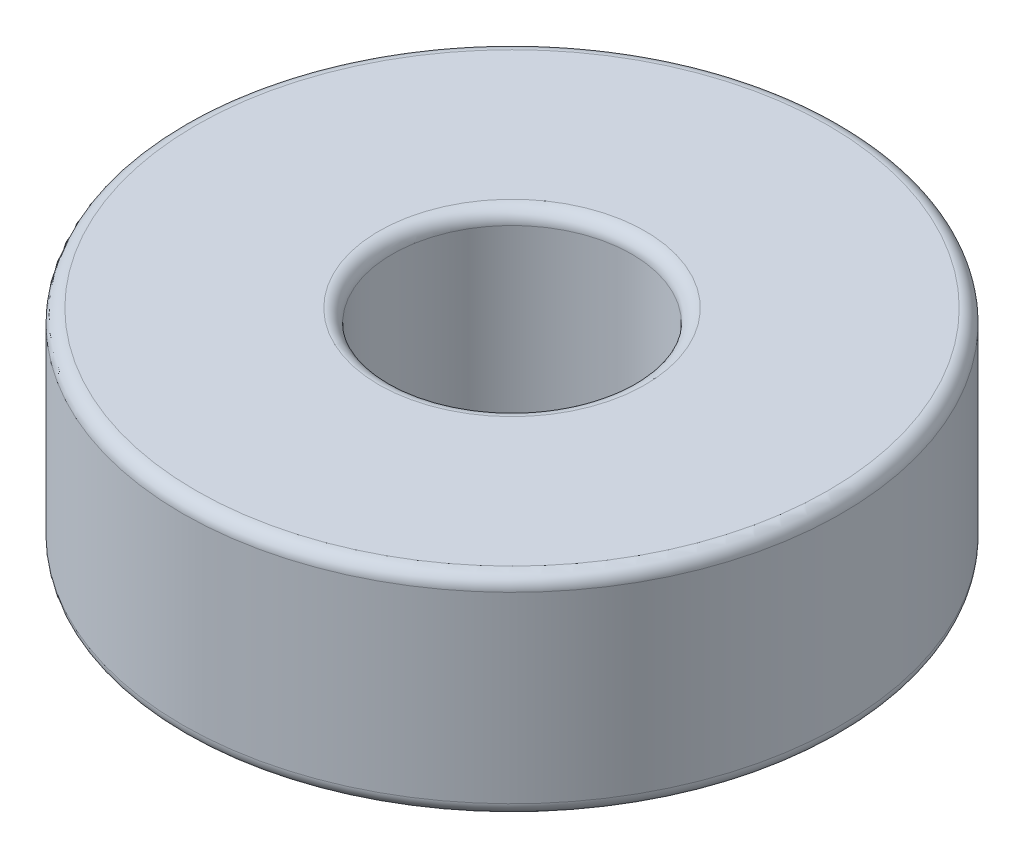
ISO-10303-21;
HEADER;
FILE_DESCRIPTION(('STEP AP214'),'2;1');
FILE_NAME('part.step','',(''),(''),'','','');
FILE_SCHEMA(('AUTOMOTIVE_DESIGN { 1 0 10303 214 1 1 1 1 }'));
ENDSEC;
DATA;
#1=APPLICATION_CONTEXT('core data for automotive mechanical design processes');
#2=APPLICATION_PROTOCOL_DEFINITION('international standard','automotive_design',2000,#1);
#3=PRODUCT_CONTEXT('',#1,'mechanical');
#4=PRODUCT('Part','Part','',(#3));
#5=PRODUCT_RELATED_PRODUCT_CATEGORY('part','',(#4));
#6=PRODUCT_DEFINITION_FORMATION('','',#4);
#7=PRODUCT_DEFINITION_CONTEXT('part definition',#1,'design');
#8=PRODUCT_DEFINITION('design','',#6,#7);
#9=PRODUCT_DEFINITION_SHAPE('','',#8);
#10=(LENGTH_UNIT() NAMED_UNIT(*) SI_UNIT(.MILLI.,.METRE.));
#11=(NAMED_UNIT(*) PLANE_ANGLE_UNIT() SI_UNIT($,.RADIAN.));
#12=(NAMED_UNIT(*) SI_UNIT($,.STERADIAN.) SOLID_ANGLE_UNIT());
#13=UNCERTAINTY_MEASURE_WITH_UNIT(LENGTH_MEASURE(1.E-05),#10,'distance_accuracy_value','');
#14=(GEOMETRIC_REPRESENTATION_CONTEXT(3) GLOBAL_UNCERTAINTY_ASSIGNED_CONTEXT((#13)) GLOBAL_UNIT_ASSIGNED_CONTEXT((#10,
#11,#12)) REPRESENTATION_CONTEXT('',''));
#15=CARTESIAN_POINT('',(0.,0.,0.));
#16=DIRECTION('',(0.,0.,1.));
#17=DIRECTION('',(1.,0.,0.));
#18=AXIS2_PLACEMENT_3D('',#15,#16,#17);
#19=CARTESIAN_POINT('',(0.,7.,0.));
#20=DIRECTION('',(0.,1.,0.));
#21=DIRECTION('',(0.,0.,1.));
#22=AXIS2_PLACEMENT_3D('',#19,#20,#21);
#23=PLANE('',#22);
#24=CARTESIAN_POINT('',(0.,7.,0.));
#25=DIRECTION('',(0.,1.,0.));
#26=DIRECTION('',(0.,0.,1.));
#27=AXIS2_PLACEMENT_3D('',#24,#25,#26);
#28=CIRCLE('',#27,4.4445);
#29=CARTESIAN_POINT('',(0.,7.,4.4445));
#30=VERTEX_POINT('',#29);
#31=EDGE_CURVE('E10',#30,#30,#28,.F.);
#32=ORIENTED_EDGE('',*,*,#31,.T.);
#33=EDGE_LOOP('',(#32));
#34=FACE_BOUND('',#33,.T.);
#35=CARTESIAN_POINT('',(0.,7.,0.));
#36=DIRECTION('',(0.,1.,0.));
#37=DIRECTION('',(0.,0.,1.));
#38=AXIS2_PLACEMENT_3D('',#35,#36,#37);
#39=CIRCLE('',#38,10.5555);
#40=CARTESIAN_POINT('',(0.,7.,10.5555));
#41=VERTEX_POINT('',#40);
#42=EDGE_CURVE('E51',#41,#41,#39,.T.);
#43=ORIENTED_EDGE('',*,*,#42,.T.);
#44=EDGE_LOOP('',(#43));
#45=FACE_BOUND('',#44,.T.);
#46=ADVANCED_FACE('F43',(#34,#45),#23,.T.);
#47=CARTESIAN_POINT('',(0.,0.,0.));
#48=DIRECTION('',(0.,1.,0.));
#49=DIRECTION('',(0.,0.,1.));
#50=AXIS2_PLACEMENT_3D('',#47,#48,#49);
#51=PLANE('',#50);
#52=CARTESIAN_POINT('',(0.,0.,0.));
#53=DIRECTION('',(0.,1.,0.));
#54=DIRECTION('',(0.,0.,1.));
#55=AXIS2_PLACEMENT_3D('',#52,#53,#54);
#56=CIRCLE('',#55,4.4445);
#57=CARTESIAN_POINT('',(0.,0.,4.4445));
#58=VERTEX_POINT('',#57);
#59=EDGE_CURVE('E75',#58,#58,#56,.T.);
#60=ORIENTED_EDGE('',*,*,#59,.T.);
#61=EDGE_LOOP('',(#60));
#62=FACE_BOUND('',#61,.T.);
#63=CARTESIAN_POINT('',(0.,0.,0.));
#64=DIRECTION('',(0.,1.,0.));
#65=DIRECTION('',(0.,0.,1.));
#66=AXIS2_PLACEMENT_3D('',#63,#64,#65);
#67=CIRCLE('',#66,10.5555);
#68=CARTESIAN_POINT('',(0.,0.,10.5555));
#69=VERTEX_POINT('',#68);
#70=EDGE_CURVE('E79',#69,#69,#67,.F.);
#71=ORIENTED_EDGE('',*,*,#70,.T.);
#72=EDGE_LOOP('',(#71));
#73=FACE_BOUND('',#72,.T.);
#74=ADVANCED_FACE('F84',(#62,#73),#51,.F.);
#75=CARTESIAN_POINT('',(0.,7.,0.));
#76=DIRECTION('',(0.,-1.,0.));
#77=DIRECTION('',(0.,0.,-1.));
#78=AXIS2_PLACEMENT_3D('',#75,#76,#77);
#79=CYLINDRICAL_SURFACE('',#78,11.);
#80=CARTESIAN_POINT('',(0.,0.4445,0.));
#81=DIRECTION('',(0.,1.,0.));
#82=DIRECTION('',(0.,0.,1.));
#83=AXIS2_PLACEMENT_3D('',#80,#81,#82);
#84=CIRCLE('',#83,11.);
#85=CARTESIAN_POINT('',(0.,0.4445,11.));
#86=VERTEX_POINT('',#85);
#87=EDGE_CURVE('E56',#86,#86,#84,.T.);
#88=ORIENTED_EDGE('',*,*,#87,.T.);
#89=EDGE_LOOP('',(#88));
#90=FACE_BOUND('',#89,.T.);
#91=CARTESIAN_POINT('',(0.,6.5555,0.));
#92=DIRECTION('',(0.,1.,0.));
#93=DIRECTION('',(0.,0.,1.));
#94=AXIS2_PLACEMENT_3D('',#91,#92,#93);
#95=CIRCLE('',#94,11.);
#96=CARTESIAN_POINT('',(0.,6.5555,11.));
#97=VERTEX_POINT('',#96);
#98=EDGE_CURVE('E61',#97,#97,#95,.F.);
#99=ORIENTED_EDGE('',*,*,#98,.T.);
#100=EDGE_LOOP('',(#99));
#101=FACE_BOUND('',#100,.T.);
#102=ADVANCED_FACE('F94',(#90,#101),#79,.T.);
#103=CARTESIAN_POINT('',(0.,7.,0.));
#104=DIRECTION('',(0.,-1.,0.));
#105=DIRECTION('',(0.,0.,-1.));
#106=AXIS2_PLACEMENT_3D('',#103,#104,#105);
#107=CYLINDRICAL_SURFACE('',#106,4.);
#108=CARTESIAN_POINT('',(0.,0.4445,0.));
#109=DIRECTION('',(0.,1.,0.));
#110=DIRECTION('',(0.,0.,1.));
#111=AXIS2_PLACEMENT_3D('',#108,#109,#110);
#112=CIRCLE('',#111,4.);
#113=CARTESIAN_POINT('',(0.,0.4445,4.));
#114=VERTEX_POINT('',#113);
#115=EDGE_CURVE('E67',#114,#114,#112,.F.);
#116=ORIENTED_EDGE('',*,*,#115,.T.);
#117=EDGE_LOOP('',(#116));
#118=FACE_BOUND('',#117,.T.);
#119=CARTESIAN_POINT('',(0.,6.5555,0.));
#120=DIRECTION('',(0.,1.,0.));
#121=DIRECTION('',(0.,0.,1.));
#122=AXIS2_PLACEMENT_3D('',#119,#120,#121);
#123=CIRCLE('',#122,4.);
#124=CARTESIAN_POINT('',(0.,6.5555,4.));
#125=VERTEX_POINT('',#124);
#126=EDGE_CURVE('E71',#125,#125,#123,.T.);
#127=ORIENTED_EDGE('',*,*,#126,.T.);
#128=EDGE_LOOP('',(#127));
#129=FACE_BOUND('',#128,.T.);
#130=ADVANCED_FACE('F97',(#118,#129),#107,.F.);
#131=CARTESIAN_POINT('',(0.,0.4445,0.));
#132=DIRECTION('',(0.,1.,0.));
#133=DIRECTION('',(0.,0.,1.));
#134=AXIS2_PLACEMENT_3D('',#131,#132,#133);
#135=TOROIDAL_SURFACE('',#134,4.4445,0.4445);
#136=ORIENTED_EDGE('',*,*,#115,.F.);
#137=EDGE_LOOP('',(#136));
#138=FACE_BOUND('',#137,.T.);
#139=ORIENTED_EDGE('',*,*,#59,.F.);
#140=EDGE_LOOP('',(#139));
#141=FACE_BOUND('',#140,.T.);
#142=ADVANCED_FACE('F90',(#138,#141),#135,.T.);
#143=CARTESIAN_POINT('',(0.,0.4445,0.));
#144=DIRECTION('',(0.,1.,0.));
#145=DIRECTION('',(0.,0.,1.));
#146=AXIS2_PLACEMENT_3D('',#143,#144,#145);
#147=TOROIDAL_SURFACE('',#146,10.5555,0.4445);
#148=ORIENTED_EDGE('',*,*,#70,.F.);
#149=EDGE_LOOP('',(#148));
#150=FACE_BOUND('',#149,.T.);
#151=ORIENTED_EDGE('',*,*,#87,.F.);
#152=EDGE_LOOP('',(#151));
#153=FACE_BOUND('',#152,.T.);
#154=ADVANCED_FACE('F86',(#150,#153),#147,.T.);
#155=CARTESIAN_POINT('',(0.,6.5555,0.));
#156=DIRECTION('',(0.,1.,0.));
#157=DIRECTION('',(0.,0.,1.));
#158=AXIS2_PLACEMENT_3D('',#155,#156,#157);
#159=TOROIDAL_SURFACE('',#158,4.4445,0.4445);
#160=ORIENTED_EDGE('',*,*,#31,.F.);
#161=EDGE_LOOP('',(#160));
#162=FACE_BOUND('',#161,.T.);
#163=ORIENTED_EDGE('',*,*,#126,.F.);
#164=EDGE_LOOP('',(#163));
#165=FACE_BOUND('',#164,.T.);
#166=ADVANCED_FACE('F89',(#162,#165),#159,.T.);
#167=CARTESIAN_POINT('',(0.,6.5555,0.));
#168=DIRECTION('',(0.,1.,0.));
#169=DIRECTION('',(0.,0.,1.));
#170=AXIS2_PLACEMENT_3D('',#167,#168,#169);
#171=TOROIDAL_SURFACE('',#170,10.5555,0.4445);
#172=ORIENTED_EDGE('',*,*,#98,.F.);
#173=EDGE_LOOP('',(#172));
#174=FACE_BOUND('',#173,.T.);
#175=ORIENTED_EDGE('',*,*,#42,.F.);
#176=EDGE_LOOP('',(#175));
#177=FACE_BOUND('',#176,.T.);
#178=ADVANCED_FACE('F45',(#174,#177),#171,.T.);
#179=CLOSED_SHELL('',(#46,#74,#102,#130,#142,#154,#166,#178));
#180=MANIFOLD_SOLID_BREP('B2',#179);
#181=ADVANCED_BREP_SHAPE_REPRESENTATION('',(#18,#180),#14);
#182=SHAPE_DEFINITION_REPRESENTATION(#9,#181);
ENDSEC;
END-ISO-10303-21;
